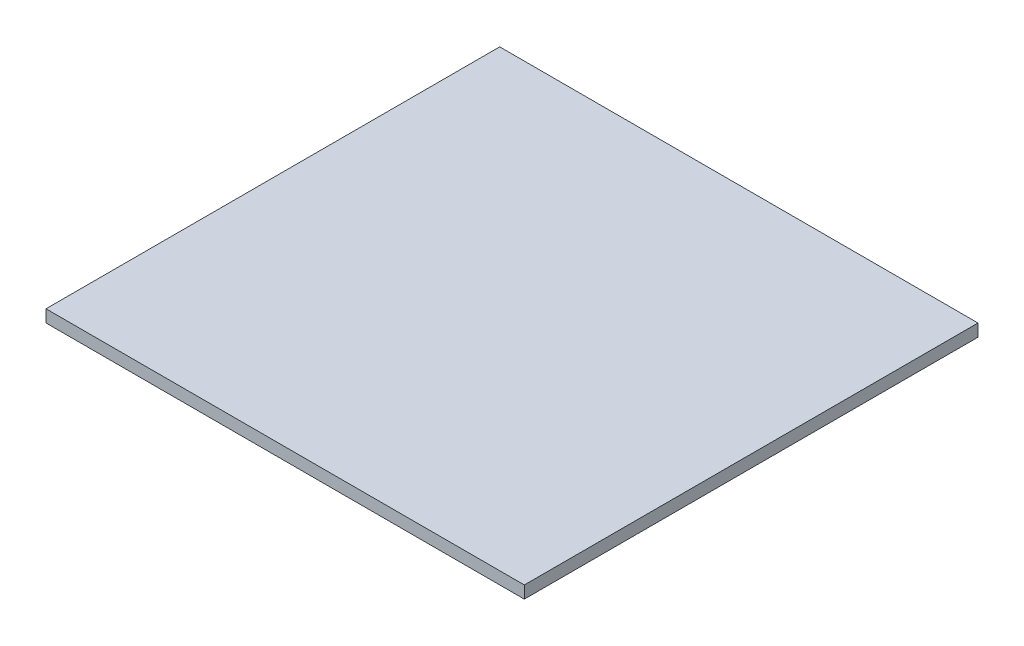
ISO-10303-21;
HEADER;
FILE_DESCRIPTION(('STEP AP214'),'2;1');
FILE_NAME('part.step','',(''),(''),'','','');
FILE_SCHEMA(('AUTOMOTIVE_DESIGN { 1 0 10303 214 1 1 1 1 }'));
ENDSEC;
DATA;
#1=APPLICATION_CONTEXT('core data for automotive mechanical design processes');
#2=APPLICATION_PROTOCOL_DEFINITION('international standard','automotive_design',2000,#1);
#3=PRODUCT_CONTEXT('',#1,'mechanical');
#4=PRODUCT('Part','Part','',(#3));
#5=PRODUCT_RELATED_PRODUCT_CATEGORY('part','',(#4));
#6=PRODUCT_DEFINITION_FORMATION('','',#4);
#7=PRODUCT_DEFINITION_CONTEXT('part definition',#1,'design');
#8=PRODUCT_DEFINITION('design','',#6,#7);
#9=PRODUCT_DEFINITION_SHAPE('','',#8);
#10=(LENGTH_UNIT() NAMED_UNIT(*) SI_UNIT(.MILLI.,.METRE.));
#11=(NAMED_UNIT(*) PLANE_ANGLE_UNIT() SI_UNIT($,.RADIAN.));
#12=(NAMED_UNIT(*) SI_UNIT($,.STERADIAN.) SOLID_ANGLE_UNIT());
#13=UNCERTAINTY_MEASURE_WITH_UNIT(LENGTH_MEASURE(1.E-05),#10,'distance_accuracy_value','');
#14=(GEOMETRIC_REPRESENTATION_CONTEXT(3) GLOBAL_UNCERTAINTY_ASSIGNED_CONTEXT((#13)) GLOBAL_UNIT_ASSIGNED_CONTEXT((#10,
#11,#12)) REPRESENTATION_CONTEXT('',''));
#15=CARTESIAN_POINT('',(0.,0.,0.));
#16=DIRECTION('',(0.,0.,1.));
#17=DIRECTION('',(1.,0.,0.));
#18=AXIS2_PLACEMENT_3D('',#15,#16,#17);
#19=CARTESIAN_POINT('',(36.9,1.9,-35.));
#20=DIRECTION('',(-1.,0.,0.));
#21=DIRECTION('',(0.,0.,1.));
#22=AXIS2_PLACEMENT_3D('',#19,#20,#21);
#23=PLANE('',#22);
#24=DIRECTION('',(0.,0.,-1.));
#25=VECTOR('',#24,1.);
#26=CARTESIAN_POINT('',(36.9,0.,-35.));
#27=LINE('',#26,#25);
#28=CARTESIAN_POINT('',(36.9,0.,35.));
#29=VERTEX_POINT('',#28);
#30=CARTESIAN_POINT('',(36.9,0.,-35.));
#31=VERTEX_POINT('',#30);
#32=EDGE_CURVE('E109',#29,#31,#27,.T.);
#33=ORIENTED_EDGE('',*,*,#32,.T.);
#34=DIRECTION('',(0.,-1.,0.));
#35=VECTOR('',#34,1.);
#36=CARTESIAN_POINT('',(36.9,1.9,-35.));
#37=LINE('',#36,#35);
#38=CARTESIAN_POINT('',(36.9,1.9,-35.));
#39=VERTEX_POINT('',#38);
#40=EDGE_CURVE('E11',#39,#31,#37,.T.);
#41=ORIENTED_EDGE('',*,*,#40,.F.);
#42=DIRECTION('',(0.,0.,-1.));
#43=VECTOR('',#42,1.);
#44=CARTESIAN_POINT('',(36.9,1.9,-35.));
#45=LINE('',#44,#43);
#46=CARTESIAN_POINT('',(36.9,1.9,35.));
#47=VERTEX_POINT('',#46);
#48=EDGE_CURVE('E92',#47,#39,#45,.T.);
#49=ORIENTED_EDGE('',*,*,#48,.F.);
#50=DIRECTION('',(0.,-1.,0.));
#51=VECTOR('',#50,1.);
#52=CARTESIAN_POINT('',(36.9,1.9,35.));
#53=LINE('',#52,#51);
#54=EDGE_CURVE('E105',#47,#29,#53,.T.);
#55=ORIENTED_EDGE('',*,*,#54,.T.);
#56=EDGE_LOOP('',(#33,#41,#49,#55));
#57=FACE_BOUND('',#56,.T.);
#58=ADVANCED_FACE('F40',(#57),#23,.F.);
#59=CARTESIAN_POINT('',(-36.9,1.9,-35.));
#60=DIRECTION('',(0.,0.,1.));
#61=DIRECTION('',(1.,0.,0.));
#62=AXIS2_PLACEMENT_3D('',#59,#60,#61);
#63=PLANE('',#62);
#64=DIRECTION('',(-1.,0.,0.));
#65=VECTOR('',#64,1.);
#66=CARTESIAN_POINT('',(-36.9,0.,-35.));
#67=LINE('',#66,#65);
#68=CARTESIAN_POINT('',(-36.9,0.,-35.));
#69=VERTEX_POINT('',#68);
#70=EDGE_CURVE('E97',#31,#69,#67,.T.);
#71=ORIENTED_EDGE('',*,*,#70,.T.);
#72=DIRECTION('',(0.,-1.,0.));
#73=VECTOR('',#72,1.);
#74=CARTESIAN_POINT('',(-36.9,1.9,-35.));
#75=LINE('',#74,#73);
#76=CARTESIAN_POINT('',(-36.9,1.9,-35.));
#77=VERTEX_POINT('',#76);
#78=EDGE_CURVE('E49',#77,#69,#75,.T.);
#79=ORIENTED_EDGE('',*,*,#78,.F.);
#80=DIRECTION('',(-1.,0.,0.));
#81=VECTOR('',#80,1.);
#82=CARTESIAN_POINT('',(-36.9,1.9,-35.));
#83=LINE('',#82,#81);
#84=EDGE_CURVE('E87',#39,#77,#83,.T.);
#85=ORIENTED_EDGE('',*,*,#84,.F.);
#86=ORIENTED_EDGE('',*,*,#40,.T.);
#87=EDGE_LOOP('',(#71,#79,#85,#86));
#88=FACE_BOUND('',#87,.T.);
#89=ADVANCED_FACE('F96',(#88),#63,.F.);
#90=CARTESIAN_POINT('',(-36.9,1.9,-35.));
#91=DIRECTION('',(1.,0.,0.));
#92=DIRECTION('',(0.,0.,-1.));
#93=AXIS2_PLACEMENT_3D('',#90,#91,#92);
#94=PLANE('',#93);
#95=DIRECTION('',(0.,0.,1.));
#96=VECTOR('',#95,1.);
#97=CARTESIAN_POINT('',(-36.9,0.,-35.));
#98=LINE('',#97,#96);
#99=CARTESIAN_POINT('',(-36.9,0.,35.));
#100=VERTEX_POINT('',#99);
#101=EDGE_CURVE('E74',#69,#100,#98,.T.);
#102=ORIENTED_EDGE('',*,*,#101,.T.);
#103=DIRECTION('',(0.,-1.,0.));
#104=VECTOR('',#103,1.);
#105=CARTESIAN_POINT('',(-36.9,1.9,35.));
#106=LINE('',#105,#104);
#107=CARTESIAN_POINT('',(-36.9,1.9,35.));
#108=VERTEX_POINT('',#107);
#109=EDGE_CURVE('E99',#108,#100,#106,.T.);
#110=ORIENTED_EDGE('',*,*,#109,.F.);
#111=DIRECTION('',(0.,0.,1.));
#112=VECTOR('',#111,1.);
#113=CARTESIAN_POINT('',(-36.9,1.9,-35.));
#114=LINE('',#113,#112);
#115=EDGE_CURVE('E90',#77,#108,#114,.T.);
#116=ORIENTED_EDGE('',*,*,#115,.F.);
#117=ORIENTED_EDGE('',*,*,#78,.T.);
#118=EDGE_LOOP('',(#102,#110,#116,#117));
#119=FACE_BOUND('',#118,.T.);
#120=ADVANCED_FACE('F100',(#119),#94,.F.);
#121=CARTESIAN_POINT('',(-36.9,1.9,35.));
#122=DIRECTION('',(0.,0.,-1.));
#123=DIRECTION('',(-1.,0.,0.));
#124=AXIS2_PLACEMENT_3D('',#121,#122,#123);
#125=PLANE('',#124);
#126=DIRECTION('',(1.,0.,0.));
#127=VECTOR('',#126,1.);
#128=CARTESIAN_POINT('',(-36.9,0.,35.));
#129=LINE('',#128,#127);
#130=EDGE_CURVE('E80',#100,#29,#129,.T.);
#131=ORIENTED_EDGE('',*,*,#130,.T.);
#132=ORIENTED_EDGE('',*,*,#54,.F.);
#133=DIRECTION('',(1.,0.,0.));
#134=VECTOR('',#133,1.);
#135=CARTESIAN_POINT('',(-36.9,1.9,35.));
#136=LINE('',#135,#134);
#137=EDGE_CURVE('E57',#108,#47,#136,.T.);
#138=ORIENTED_EDGE('',*,*,#137,.F.);
#139=ORIENTED_EDGE('',*,*,#109,.T.);
#140=EDGE_LOOP('',(#131,#132,#138,#139));
#141=FACE_BOUND('',#140,.T.);
#142=ADVANCED_FACE('F123',(#141),#125,.F.);
#143=CARTESIAN_POINT('',(0.,1.9,0.));
#144=DIRECTION('',(0.,1.,0.));
#145=DIRECTION('',(0.,0.,1.));
#146=AXIS2_PLACEMENT_3D('',#143,#144,#145);
#147=PLANE('',#146);
#148=ORIENTED_EDGE('',*,*,#48,.T.);
#149=ORIENTED_EDGE('',*,*,#84,.T.);
#150=ORIENTED_EDGE('',*,*,#115,.T.);
#151=ORIENTED_EDGE('',*,*,#137,.T.);
#152=EDGE_LOOP('',(#148,#149,#150,#151));
#153=FACE_BOUND('',#152,.T.);
#154=ADVANCED_FACE('F88',(#153),#147,.T.);
#155=CARTESIAN_POINT('',(0.,0.,0.));
#156=DIRECTION('',(0.,1.,0.));
#157=DIRECTION('',(0.,0.,1.));
#158=AXIS2_PLACEMENT_3D('',#155,#156,#157);
#159=PLANE('',#158);
#160=ORIENTED_EDGE('',*,*,#32,.F.);
#161=ORIENTED_EDGE('',*,*,#130,.F.);
#162=ORIENTED_EDGE('',*,*,#101,.F.);
#163=ORIENTED_EDGE('',*,*,#70,.F.);
#164=EDGE_LOOP('',(#160,#161,#162,#163));
#165=FACE_BOUND('',#164,.T.);
#166=ADVANCED_FACE('F126',(#165),#159,.F.);
#167=CLOSED_SHELL('',(#58,#89,#120,#142,#154,#166));
#168=MANIFOLD_SOLID_BREP('B2',#167);
#169=ADVANCED_BREP_SHAPE_REPRESENTATION('',(#18,#168),#14);
#170=SHAPE_DEFINITION_REPRESENTATION(#9,#169);
ENDSEC;
END-ISO-10303-21;
